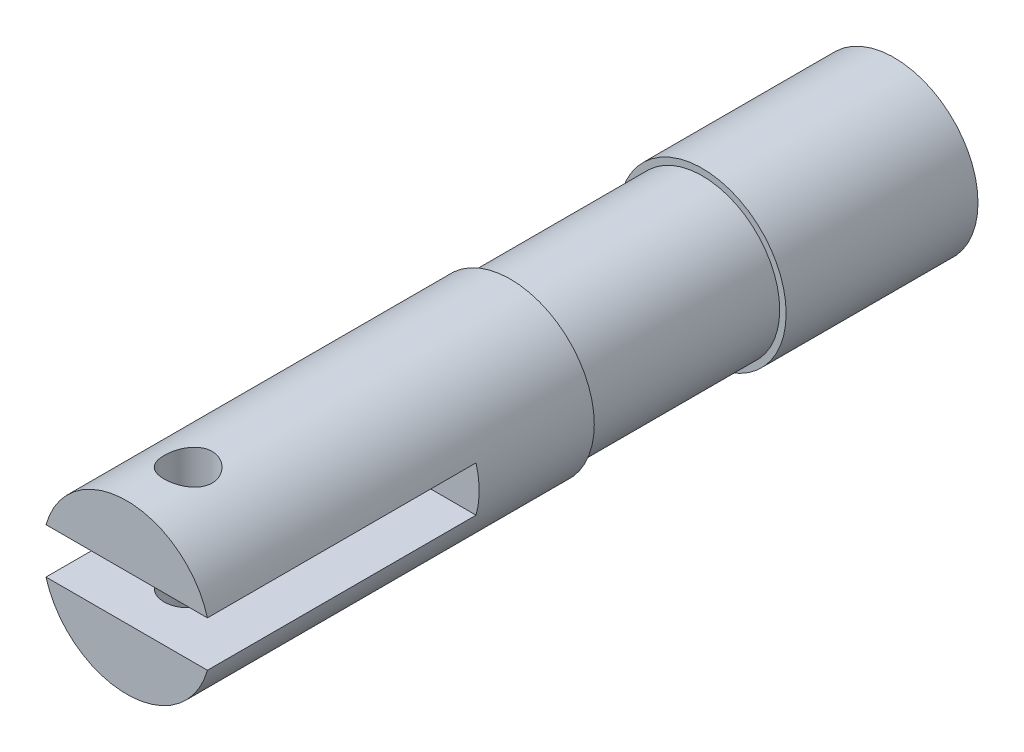
ISO-10303-21;
HEADER;
FILE_DESCRIPTION(('STEP AP214'),'2;1');
FILE_NAME('part.step','',(''),(''),'','','');
FILE_SCHEMA(('AUTOMOTIVE_DESIGN { 1 0 10303 214 1 1 1 1 }'));
ENDSEC;
DATA;
#1=APPLICATION_CONTEXT('core data for automotive mechanical design processes');
#2=APPLICATION_PROTOCOL_DEFINITION('international standard','automotive_design',2000,#1);
#3=PRODUCT_CONTEXT('',#1,'mechanical');
#4=PRODUCT('Part','Part','',(#3));
#5=PRODUCT_RELATED_PRODUCT_CATEGORY('part','',(#4));
#6=PRODUCT_DEFINITION_FORMATION('','',#4);
#7=PRODUCT_DEFINITION_CONTEXT('part definition',#1,'design');
#8=PRODUCT_DEFINITION('design','',#6,#7);
#9=PRODUCT_DEFINITION_SHAPE('','',#8);
#10=(LENGTH_UNIT() NAMED_UNIT(*) SI_UNIT(.MILLI.,.METRE.));
#11=(NAMED_UNIT(*) PLANE_ANGLE_UNIT() SI_UNIT($,.RADIAN.));
#12=(NAMED_UNIT(*) SI_UNIT($,.STERADIAN.) SOLID_ANGLE_UNIT());
#13=UNCERTAINTY_MEASURE_WITH_UNIT(LENGTH_MEASURE(1.E-05),#10,'distance_accuracy_value','');
#14=(GEOMETRIC_REPRESENTATION_CONTEXT(3) GLOBAL_UNCERTAINTY_ASSIGNED_CONTEXT((#13)) GLOBAL_UNIT_ASSIGNED_CONTEXT((#10,
#11,#12)) REPRESENTATION_CONTEXT('',''));
#15=CARTESIAN_POINT('',(0.,0.,0.));
#16=DIRECTION('',(0.,0.,1.));
#17=DIRECTION('',(1.,0.,0.));
#18=AXIS2_PLACEMENT_3D('',#15,#16,#17);
#19=CARTESIAN_POINT('',(0.,0.,38.1));
#20=DIRECTION('',(0.,0.,1.));
#21=DIRECTION('',(1.,0.,0.));
#22=AXIS2_PLACEMENT_3D('',#19,#20,#21);
#23=PLANE('',#22);
#24=DIRECTION('',(1.,0.,0.));
#25=VECTOR('',#24,1.);
#26=CARTESIAN_POINT('',(5.34335007368973,-1.5,38.1));
#27=LINE('',#26,#25);
#28=CARTESIAN_POINT('',(-5.34335007368973,-1.5,38.1));
#29=VERTEX_POINT('',#28);
#30=CARTESIAN_POINT('',(5.34335007368973,-1.5,38.1));
#31=VERTEX_POINT('',#30);
#32=EDGE_CURVE('E73',#29,#31,#27,.T.);
#33=ORIENTED_EDGE('',*,*,#32,.F.);
#34=CARTESIAN_POINT('',(0.,0.,38.1));
#35=DIRECTION('',(0.,0.,1.));
#36=DIRECTION('',(1.,0.,0.));
#37=AXIS2_PLACEMENT_3D('',#34,#35,#36);
#38=CIRCLE('',#37,5.5499);
#39=EDGE_CURVE('E43',#29,#31,#38,.T.);
#40=ORIENTED_EDGE('',*,*,#39,.T.);
#41=EDGE_LOOP('',(#33,#40));
#42=FACE_BOUND('',#41,.T.);
#43=ADVANCED_FACE('F33',(#42),#23,.T.);
#44=CARTESIAN_POINT('',(0.,0.,38.1));
#45=DIRECTION('',(0.,0.,-1.));
#46=DIRECTION('',(-1.,0.,0.));
#47=AXIS2_PLACEMENT_3D('',#44,#45,#46);
#48=CYLINDRICAL_SURFACE('',#47,5.5499);
#49=CARTESIAN_POINT('',(0.,0.,12.7));
#50=DIRECTION('',(0.,0.,1.));
#51=DIRECTION('',(1.,0.,0.));
#52=AXIS2_PLACEMENT_3D('',#49,#50,#51);
#53=CIRCLE('',#52,5.5499);
#54=CARTESIAN_POINT('',(5.5499,0.,12.7));
#55=VERTEX_POINT('',#54);
#56=EDGE_CURVE('E205',#55,#55,#53,.T.);
#57=ORIENTED_EDGE('',*,*,#56,.T.);
#58=EDGE_LOOP('',(#57));
#59=FACE_BOUND('',#58,.T.);
#60=CARTESIAN_POINT('',(0.,-5.5499,35.6235));
#61=CARTESIAN_POINT('',(0.0872724941734618,-5.54989896834257,35.6234984707263));
#62=CARTESIAN_POINT('',(0.174560703502965,-5.54782151876623,35.616279329323));
#63=CARTESIAN_POINT('',(0.346606940531385,-5.53973656836404,35.5876544648309));
#64=CARTESIAN_POINT('',(0.431364002750902,-5.53372758742275,35.5662433988258));
#65=CARTESIAN_POINT('',(0.595840818901869,-5.5184400865301,35.5099994785404));
#66=CARTESIAN_POINT('',(0.67556742518667,-5.50916613260381,35.475185361936));
#67=CARTESIAN_POINT('',(0.828051249460755,-5.48831953110385,35.3931972803331));
#68=CARTESIAN_POINT('',(0.900807732623364,-5.47674664155886,35.3460220141118));
#69=CARTESIAN_POINT('',(1.03920274769103,-5.45220218024309,35.2393399803399));
#70=CARTESIAN_POINT('',(1.10463159844073,-5.43920395049827,35.1795673402887));
#71=CARTESIAN_POINT('',(1.22468673918585,-5.41343794561223,35.0499546370002));
#72=CARTESIAN_POINT('',(1.27931140513751,-5.40067020537901,34.9801130629631));
#73=CARTESIAN_POINT('',(1.37727563395375,-5.37653289566469,34.8306144523242));
#74=CARTESIAN_POINT('',(1.42036565049793,-5.36519667943514,34.7507880056001));
#75=CARTESIAN_POINT('',(1.492426810994,-5.34560161598978,34.5846458384256));
#76=CARTESIAN_POINT('',(1.52140100010062,-5.33734210513839,34.4983315222208));
#77=CARTESIAN_POINT('',(1.56366394470877,-5.3251123216805,34.3240049091784));
#78=CARTESIAN_POINT('',(1.5773365731521,-5.32103729970711,34.2360932145847));
#79=CARTESIAN_POINT('',(1.5898062139296,-5.31732566668083,34.0591366395856));
#80=CARTESIAN_POINT('',(1.58860646672983,-5.31768808877569,33.9700920102533));
#81=CARTESIAN_POINT('',(1.57166831728128,-5.32271715888212,33.79646347849));
#82=CARTESIAN_POINT('',(1.55640357651009,-5.32724356991789,33.7118286456561));
#83=CARTESIAN_POINT('',(1.5125311528114,-5.3398647394061,33.5463749255446));
#84=CARTESIAN_POINT('',(1.48392226116893,-5.34795982110557,33.4655563846777));
#85=CARTESIAN_POINT('',(1.41380896237254,-5.36692299778615,33.3088381409805));
#86=CARTESIAN_POINT('',(1.37214561459069,-5.37782495836647,33.233013817701));
#87=CARTESIAN_POINT('',(1.27721669134951,-5.40115641330293,33.089270670165));
#88=CARTESIAN_POINT('',(1.2239485277728,-5.41358624813717,33.0213536145878));
#89=CARTESIAN_POINT('',(1.10493957469359,-5.4391481877115,32.8926575917568));
#90=CARTESIAN_POINT('',(1.03880362337619,-5.45228908339256,32.8322452082636));
#91=CARTESIAN_POINT('',(0.897176515351795,-5.47737426652169,32.7232878433217));
#92=CARTESIAN_POINT('',(0.821684871916074,-5.4893184916546,32.674743479696));
#93=CARTESIAN_POINT('',(0.662865835839815,-5.51075738718829,32.5907044686441));
#94=CARTESIAN_POINT('',(0.57949681653771,-5.52023792341386,32.5552846434936));
#95=CARTESIAN_POINT('',(0.407652430488587,-5.53557938747209,32.4990736669459));
#96=CARTESIAN_POINT('',(0.319178359995337,-5.54144122976479,32.4782788195667));
#97=CARTESIAN_POINT('',(0.142756904957587,-5.54874291946734,32.4525033260106));
#98=CARTESIAN_POINT('',(0.0548878476549356,-5.55032182170101,32.4470252014117));
#99=CARTESIAN_POINT('',(-0.120516599761047,-5.5492841581313,32.450653159662));
#100=CARTESIAN_POINT('',(-0.208052028741161,-5.54666809699664,32.459757488191));
#101=CARTESIAN_POINT('',(-0.378470860253106,-5.53762500887942,32.4918869379715));
#102=CARTESIAN_POINT('',(-0.461412521218146,-5.53127605002489,32.5146270743796));
#103=CARTESIAN_POINT('',(-0.622290119879763,-5.51549490931321,32.5730449298635));
#104=CARTESIAN_POINT('',(-0.700225476885458,-5.50606237055554,32.6087241465899));
#105=CARTESIAN_POINT('',(-0.850753159224852,-5.48484424367827,32.6928799028103));
#106=CARTESIAN_POINT('',(-0.923192994094234,-5.47301207001095,32.7416171468307));
#107=CARTESIAN_POINT('',(-1.0590378769447,-5.44835784490299,32.8501841160898));
#108=CARTESIAN_POINT('',(-1.12244085910737,-5.435535568155,32.9100163704704));
#109=CARTESIAN_POINT('',(-1.24056312535877,-5.4098217989191,33.041407019302));
#110=CARTESIAN_POINT('',(-1.29492951097843,-5.39694182256213,33.1132855772011));
#111=CARTESIAN_POINT('',(-1.39084613724155,-5.37302425024348,33.265423494594));
#112=CARTESIAN_POINT('',(-1.43239682171947,-5.36198659048461,33.3456825637244));
#113=CARTESIAN_POINT('',(-1.50119996213611,-5.34313227372482,33.5119718633803));
#114=CARTESIAN_POINT('',(-1.5285280201113,-5.33529863403326,33.5979687793713));
#115=CARTESIAN_POINT('',(-1.56824907412348,-5.32376003488255,33.7736051845963));
#116=CARTESIAN_POINT('',(-1.58064660859896,-5.32005382083362,33.8632435583659));
#117=CARTESIAN_POINT('',(-1.58986590919384,-5.31730537323854,34.0399760141655));
#118=CARTESIAN_POINT('',(-1.58725928591541,-5.31809196891816,34.1270380292939));
#119=CARTESIAN_POINT('',(-1.56789208986272,-5.32383360267543,34.2994260675869));
#120=CARTESIAN_POINT('',(-1.5511319914117,-5.32878850106137,34.3847521488293));
#121=CARTESIAN_POINT('',(-1.50428702898885,-5.34219902911262,34.5504050400885));
#122=CARTESIAN_POINT('',(-1.47434045539563,-5.35061826870816,34.6307741163339));
#123=CARTESIAN_POINT('',(-1.4020796024876,-5.37000520636908,34.785410637239));
#124=CARTESIAN_POINT('',(-1.35976313016336,-5.38097335624974,34.8596769969793));
#125=CARTESIAN_POINT('',(-1.26230376619992,-5.40468042481964,35.0026856153301));
#126=CARTESIAN_POINT('',(-1.20677913620843,-5.41746630785813,35.0711599511871));
#127=CARTESIAN_POINT('',(-1.08518341968836,-5.44312611056358,35.1980047316258));
#128=CARTESIAN_POINT('',(-1.01910967936042,-5.45600005160085,35.2563726260464));
#129=CARTESIAN_POINT('',(-0.876241567528388,-5.48078223121342,35.3628363749627));
#130=CARTESIAN_POINT('',(-0.799215077834475,-5.49265709499021,35.4106292533314));
#131=CARTESIAN_POINT('',(-0.637880821638567,-5.5137190316164,35.4925154594953));
#132=CARTESIAN_POINT('',(-0.553577051886057,-5.52290756780932,35.5266162496799));
#133=CARTESIAN_POINT('',(-0.391513919834384,-5.53659021644685,35.576483981923));
#134=CARTESIAN_POINT('',(-0.314348637182838,-5.54154229767636,35.5940702648676));
#135=CARTESIAN_POINT('',(-0.158126365730265,-5.54819743833673,35.6175781823509));
#136=CARTESIAN_POINT('',(-0.0790696327709008,-5.54990093469053,35.6235013855352));
#137=CARTESIAN_POINT('',(0.,-5.5499,35.6235));
#138=B_SPLINE_CURVE_WITH_KNOTS('',3,(#60,#61,#62,#63,#64,#65,#66,#67,#68,#69,#70,#71,#72,#73,
#74,#75,#76,#77,#78,#79,#80,#81,#82,#83,#84,#85,#86,#87,#88,#89,#90,#91,#92,#93,#94,#95,#96,#97,
#98,#99,#100,#101,#102,#103,#104,#105,#106,#107,#108,#109,#110,#111,#112,#113,#114,#115,#116,
#117,#118,#119,#120,#121,#122,#123,#124,#125,#126,#127,#128,#129,#130,#131,#132,#133,#134,#135,
#136,#137),.UNSPECIFIED.,.T.,.F.,(4,2,2,2,2,2,2,2,2,2,2,2,2,2,2,2,2,2,2,2,2,2,2,2,2,2,2,2,2,2,2,
2,2,2,2,2,2,2,4),(0.,0.261527247969741,0.523153010586956,0.784414336708987,1.04570317611949,
1.31318750640695,1.58071201341046,1.85362659669269,2.1264822790327,2.39232759881921,
2.65811499594338,2.91526634006719,3.17244098151897,3.43287713201013,3.69337142479462,
3.96370648798546,4.23405562123313,4.50592311488859,4.77772187826597,5.04058411128749,
5.30341472343887,5.56093487145812,5.81848483600105,6.08161913851189,6.34481349720002,
6.61663779663824,6.88845268117654,7.15880755200923,7.42908022218125,7.68912623370909,
7.94916353070069,8.206536383815,8.46395489322526,8.72998514974431,8.99608243623522,
9.26902710891233,9.54182282014954,9.77880063836502,10.0157465816705),.UNSPECIFIED.);
#139=CARTESIAN_POINT('',(0.,-5.5499,35.6235));
#140=VERTEX_POINT('',#139);
#141=EDGE_CURVE('E102',#140,#140,#138,.T.);
#142=ORIENTED_EDGE('',*,*,#141,.T.);
#143=EDGE_LOOP('',(#142));
#144=FACE_BOUND('',#143,.T.);
#145=CARTESIAN_POINT('',(0.,5.5499,35.6235));
#146=CARTESIAN_POINT('',(-0.0872724941734618,5.54989896834257,35.6234984707263));
#147=CARTESIAN_POINT('',(-0.174560703502965,5.54782151876623,35.616279329323));
#148=CARTESIAN_POINT('',(-0.346606940531385,5.53973656836404,35.5876544648309));
#149=CARTESIAN_POINT('',(-0.431364002750902,5.53372758742275,35.5662433988258));
#150=CARTESIAN_POINT('',(-0.595840818901869,5.5184400865301,35.5099994785404));
#151=CARTESIAN_POINT('',(-0.67556742518667,5.50916613260381,35.475185361936));
#152=CARTESIAN_POINT('',(-0.828051249460755,5.48831953110385,35.3931972803331));
#153=CARTESIAN_POINT('',(-0.900807732623364,5.47674664155886,35.3460220141118));
#154=CARTESIAN_POINT('',(-1.03920274769103,5.45220218024309,35.2393399803399));
#155=CARTESIAN_POINT('',(-1.10463159844073,5.43920395049827,35.1795673402887));
#156=CARTESIAN_POINT('',(-1.22468673918585,5.41343794561223,35.0499546370002));
#157=CARTESIAN_POINT('',(-1.27931140513751,5.40067020537901,34.9801130629631));
#158=CARTESIAN_POINT('',(-1.37727563395375,5.37653289566469,34.8306144523242));
#159=CARTESIAN_POINT('',(-1.42036565049793,5.36519667943514,34.7507880056001));
#160=CARTESIAN_POINT('',(-1.492426810994,5.34560161598978,34.5846458384256));
#161=CARTESIAN_POINT('',(-1.52140100010062,5.33734210513839,34.4983315222208));
#162=CARTESIAN_POINT('',(-1.56366394470877,5.3251123216805,34.3240049091784));
#163=CARTESIAN_POINT('',(-1.5773365731521,5.32103729970711,34.2360932145847));
#164=CARTESIAN_POINT('',(-1.5898062139296,5.31732566668083,34.0591366395856));
#165=CARTESIAN_POINT('',(-1.58860646672983,5.31768808877569,33.9700920102533));
#166=CARTESIAN_POINT('',(-1.57166831728128,5.32271715888212,33.79646347849));
#167=CARTESIAN_POINT('',(-1.55640357651009,5.32724356991789,33.7118286456561));
#168=CARTESIAN_POINT('',(-1.5125311528114,5.3398647394061,33.5463749255446));
#169=CARTESIAN_POINT('',(-1.48392226116893,5.34795982110557,33.4655563846777));
#170=CARTESIAN_POINT('',(-1.41380896237254,5.36692299778615,33.3088381409805));
#171=CARTESIAN_POINT('',(-1.37214561459069,5.37782495836647,33.233013817701));
#172=CARTESIAN_POINT('',(-1.27721669134951,5.40115641330293,33.089270670165));
#173=CARTESIAN_POINT('',(-1.2239485277728,5.41358624813717,33.0213536145878));
#174=CARTESIAN_POINT('',(-1.10493957469359,5.4391481877115,32.8926575917568));
#175=CARTESIAN_POINT('',(-1.03880362337619,5.45228908339256,32.8322452082636));
#176=CARTESIAN_POINT('',(-0.897176515351795,5.47737426652169,32.7232878433217));
#177=CARTESIAN_POINT('',(-0.821684871916074,5.4893184916546,32.674743479696));
#178=CARTESIAN_POINT('',(-0.662865835839815,5.51075738718829,32.5907044686441));
#179=CARTESIAN_POINT('',(-0.57949681653771,5.52023792341386,32.5552846434936));
#180=CARTESIAN_POINT('',(-0.407652430488587,5.53557938747209,32.4990736669459));
#181=CARTESIAN_POINT('',(-0.319178359995337,5.54144122976479,32.4782788195667));
#182=CARTESIAN_POINT('',(-0.142756904957587,5.54874291946734,32.4525033260106));
#183=CARTESIAN_POINT('',(-0.0548878476549356,5.55032182170101,32.4470252014117));
#184=CARTESIAN_POINT('',(0.120516599761047,5.5492841581313,32.450653159662));
#185=CARTESIAN_POINT('',(0.208052028741161,5.54666809699664,32.459757488191));
#186=CARTESIAN_POINT('',(0.378470860253106,5.53762500887942,32.4918869379715));
#187=CARTESIAN_POINT('',(0.461412521218146,5.53127605002489,32.5146270743796));
#188=CARTESIAN_POINT('',(0.622290119879763,5.51549490931321,32.5730449298635));
#189=CARTESIAN_POINT('',(0.700225476885458,5.50606237055554,32.6087241465899));
#190=CARTESIAN_POINT('',(0.850753159224852,5.48484424367827,32.6928799028103));
#191=CARTESIAN_POINT('',(0.923192994094234,5.47301207001095,32.7416171468307));
#192=CARTESIAN_POINT('',(1.0590378769447,5.44835784490299,32.8501841160898));
#193=CARTESIAN_POINT('',(1.12244085910737,5.435535568155,32.9100163704704));
#194=CARTESIAN_POINT('',(1.24056312535877,5.4098217989191,33.041407019302));
#195=CARTESIAN_POINT('',(1.29492951097843,5.39694182256213,33.1132855772011));
#196=CARTESIAN_POINT('',(1.39084613724155,5.37302425024348,33.265423494594));
#197=CARTESIAN_POINT('',(1.43239682171947,5.36198659048461,33.3456825637244));
#198=CARTESIAN_POINT('',(1.50119996213611,5.34313227372482,33.5119718633803));
#199=CARTESIAN_POINT('',(1.5285280201113,5.33529863403326,33.5979687793713));
#200=CARTESIAN_POINT('',(1.56824907412348,5.32376003488255,33.7736051845963));
#201=CARTESIAN_POINT('',(1.58064660859896,5.32005382083362,33.8632435583659));
#202=CARTESIAN_POINT('',(1.58986590919384,5.31730537323854,34.0399760141655));
#203=CARTESIAN_POINT('',(1.58725928591541,5.31809196891816,34.1270380292939));
#204=CARTESIAN_POINT('',(1.56789208986272,5.32383360267543,34.2994260675869));
#205=CARTESIAN_POINT('',(1.5511319914117,5.32878850106137,34.3847521488293));
#206=CARTESIAN_POINT('',(1.50428702898885,5.34219902911262,34.5504050400885));
#207=CARTESIAN_POINT('',(1.47434045539563,5.35061826870816,34.6307741163339));
#208=CARTESIAN_POINT('',(1.4020796024876,5.37000520636908,34.785410637239));
#209=CARTESIAN_POINT('',(1.35976313016336,5.38097335624974,34.8596769969793));
#210=CARTESIAN_POINT('',(1.26230376619992,5.40468042481964,35.0026856153301));
#211=CARTESIAN_POINT('',(1.20677913620843,5.41746630785813,35.0711599511871));
#212=CARTESIAN_POINT('',(1.08518341968836,5.44312611056358,35.1980047316258));
#213=CARTESIAN_POINT('',(1.01910967936042,5.45600005160085,35.2563726260464));
#214=CARTESIAN_POINT('',(0.876241567528388,5.48078223121342,35.3628363749627));
#215=CARTESIAN_POINT('',(0.799215077834475,5.49265709499021,35.4106292533314));
#216=CARTESIAN_POINT('',(0.637880821638567,5.5137190316164,35.4925154594953));
#217=CARTESIAN_POINT('',(0.553577051886057,5.52290756780932,35.5266162496799));
#218=CARTESIAN_POINT('',(0.391513919834384,5.53659021644685,35.576483981923));
#219=CARTESIAN_POINT('',(0.314348637182838,5.54154229767636,35.5940702648676));
#220=CARTESIAN_POINT('',(0.158126365730265,5.54819743833673,35.6175781823509));
#221=CARTESIAN_POINT('',(0.0790696327709008,5.54990093469053,35.6235013855352));
#222=CARTESIAN_POINT('',(0.,5.5499,35.6235));
#223=B_SPLINE_CURVE_WITH_KNOTS('',3,(#145,#146,#147,#148,#149,#150,#151,#152,#153,#154,#155,
#156,#157,#158,#159,#160,#161,#162,#163,#164,#165,#166,#167,#168,#169,#170,#171,#172,#173,#174,
#175,#176,#177,#178,#179,#180,#181,#182,#183,#184,#185,#186,#187,#188,#189,#190,#191,#192,#193,
#194,#195,#196,#197,#198,#199,#200,#201,#202,#203,#204,#205,#206,#207,#208,#209,#210,#211,#212,
#213,#214,#215,#216,#217,#218,#219,#220,#221,#222),.UNSPECIFIED.,.T.,.F.,(4,2,2,2,2,2,2,2,2,2,2,
2,2,2,2,2,2,2,2,2,2,2,2,2,2,2,2,2,2,2,2,2,2,2,2,2,2,2,4),(0.,0.261527247969741,
0.523153010586956,0.784414336708987,1.04570317611949,1.31318750640695,1.58071201341046,
1.85362659669269,2.1264822790327,2.39232759881921,2.65811499594338,2.91526634006719,
3.17244098151897,3.43287713201013,3.69337142479462,3.96370648798546,4.23405562123313,
4.50592311488859,4.77772187826597,5.04058411128749,5.30341472343887,5.56093487145812,
5.81848483600105,6.08161913851189,6.34481349720002,6.61663779663824,6.88845268117654,
7.15880755200923,7.42908022218125,7.68912623370909,7.94916353070069,8.206536383815,
8.46395489322526,8.72998514974431,8.99608243623522,9.26902710891233,9.54182282014954,
9.77880063836502,10.0157465816705),.UNSPECIFIED.);
#224=CARTESIAN_POINT('',(0.,5.5499,35.6235));
#225=VERTEX_POINT('',#224);
#226=EDGE_CURVE('E115',#225,#225,#223,.T.);
#227=ORIENTED_EDGE('',*,*,#226,.T.);
#228=EDGE_LOOP('',(#227));
#229=FACE_BOUND('',#228,.T.);
#230=ORIENTED_EDGE('',*,*,#39,.F.);
#231=DIRECTION('',(0.,0.,1.));
#232=VECTOR('',#231,1.);
#233=CARTESIAN_POINT('',(-5.34335007368973,-1.5,20.32));
#234=LINE('',#233,#232);
#235=CARTESIAN_POINT('',(-5.34335007368973,-1.5,20.32));
#236=VERTEX_POINT('',#235);
#237=EDGE_CURVE('E86',#236,#29,#234,.T.);
#238=ORIENTED_EDGE('',*,*,#237,.F.);
#239=CARTESIAN_POINT('',(0.,0.,20.32));
#240=DIRECTION('',(0.,0.,1.));
#241=DIRECTION('',(1.,0.,0.));
#242=AXIS2_PLACEMENT_3D('',#239,#240,#241);
#243=CIRCLE('',#242,5.5499);
#244=CARTESIAN_POINT('',(-5.34335007368973,1.5,20.32));
#245=VERTEX_POINT('',#244);
#246=EDGE_CURVE('E90',#245,#236,#243,.T.);
#247=ORIENTED_EDGE('',*,*,#246,.F.);
#248=DIRECTION('',(0.,0.,1.));
#249=VECTOR('',#248,1.);
#250=CARTESIAN_POINT('',(-5.34335007368973,1.5,20.32));
#251=LINE('',#250,#249);
#252=CARTESIAN_POINT('',(-5.34335007368973,1.5,38.1));
#253=VERTEX_POINT('',#252);
#254=EDGE_CURVE('E80',#245,#253,#251,.T.);
#255=ORIENTED_EDGE('',*,*,#254,.T.);
#256=CARTESIAN_POINT('',(5.34335007368973,1.5,38.1));
#257=VERTEX_POINT('',#256);
#258=EDGE_CURVE('E11',#257,#253,#38,.T.);
#259=ORIENTED_EDGE('',*,*,#258,.F.);
#260=DIRECTION('',(0.,0.,1.));
#261=VECTOR('',#260,1.);
#262=CARTESIAN_POINT('',(5.34335007368973,1.5,20.32));
#263=LINE('',#262,#261);
#264=CARTESIAN_POINT('',(5.34335007368973,1.5,20.32));
#265=VERTEX_POINT('',#264);
#266=EDGE_CURVE('E50',#265,#257,#263,.T.);
#267=ORIENTED_EDGE('',*,*,#266,.F.);
#268=CARTESIAN_POINT('',(0.,0.,20.32));
#269=DIRECTION('',(0.,0.,1.));
#270=DIRECTION('',(1.,0.,0.));
#271=AXIS2_PLACEMENT_3D('',#268,#269,#270);
#272=CIRCLE('',#271,5.5499);
#273=CARTESIAN_POINT('',(5.34335007368973,-1.5,20.32));
#274=VERTEX_POINT('',#273);
#275=EDGE_CURVE('E92',#274,#265,#272,.T.);
#276=ORIENTED_EDGE('',*,*,#275,.F.);
#277=DIRECTION('',(0.,0.,1.));
#278=VECTOR('',#277,1.);
#279=CARTESIAN_POINT('',(5.34335007368973,-1.5,20.32));
#280=LINE('',#279,#278);
#281=EDGE_CURVE('E59',#274,#31,#280,.T.);
#282=ORIENTED_EDGE('',*,*,#281,.T.);
#283=EDGE_LOOP('',(#230,#238,#247,#255,#259,#267,#276,#282));
#284=FACE_BOUND('',#283,.T.);
#285=ADVANCED_FACE('F35',(#59,#144,#229,#284),#48,.T.);
#286=DIRECTION('',(-1.,0.,0.));
#287=VECTOR('',#286,1.);
#288=CARTESIAN_POINT('',(5.34335007368973,1.5,38.1));
#289=LINE('',#288,#287);
#290=EDGE_CURVE('E82',#257,#253,#289,.T.);
#291=ORIENTED_EDGE('',*,*,#290,.F.);
#292=ORIENTED_EDGE('',*,*,#258,.T.);
#293=EDGE_LOOP('',(#291,#292));
#294=FACE_BOUND('',#293,.T.);
#295=ADVANCED_FACE('F134',(#294),#23,.T.);
#296=CARTESIAN_POINT('',(5.34335007368973,-1.5,20.32));
#297=DIRECTION('',(0.,-1.,0.));
#298=DIRECTION('',(0.,0.,-1.));
#299=AXIS2_PLACEMENT_3D('',#296,#297,#298);
#300=PLANE('',#299);
#301=CARTESIAN_POINT('',(0.,-1.5,34.036));
#302=DIRECTION('',(0.,-1.,0.));
#303=DIRECTION('',(0.,0.,-1.));
#304=AXIS2_PLACEMENT_3D('',#301,#302,#303);
#305=CIRCLE('',#304,1.5875);
#306=CARTESIAN_POINT('',(0.,-1.5,32.4485));
#307=VERTEX_POINT('',#306);
#308=EDGE_CURVE('E208',#307,#307,#305,.T.);
#309=ORIENTED_EDGE('',*,*,#308,.T.);
#310=EDGE_LOOP('',(#309));
#311=FACE_BOUND('',#310,.T.);
#312=ORIENTED_EDGE('',*,*,#32,.T.);
#313=ORIENTED_EDGE('',*,*,#281,.F.);
#314=DIRECTION('',(1.,0.,0.));
#315=VECTOR('',#314,1.);
#316=CARTESIAN_POINT('',(5.34335007368973,-1.5,20.32));
#317=LINE('',#316,#315);
#318=EDGE_CURVE('E96',#236,#274,#317,.T.);
#319=ORIENTED_EDGE('',*,*,#318,.F.);
#320=ORIENTED_EDGE('',*,*,#237,.T.);
#321=EDGE_LOOP('',(#312,#313,#319,#320));
#322=FACE_BOUND('',#321,.T.);
#323=ADVANCED_FACE('F106',(#311,#322),#300,.F.);
#324=CARTESIAN_POINT('',(5.34335007368973,1.5,20.32));
#325=DIRECTION('',(0.,1.,0.));
#326=DIRECTION('',(0.,0.,1.));
#327=AXIS2_PLACEMENT_3D('',#324,#325,#326);
#328=PLANE('',#327);
#329=CARTESIAN_POINT('',(0.,1.5,34.036));
#330=DIRECTION('',(0.,1.,0.));
#331=DIRECTION('',(0.,0.,1.));
#332=AXIS2_PLACEMENT_3D('',#329,#330,#331);
#333=CIRCLE('',#332,1.5875);
#334=CARTESIAN_POINT('',(0.,1.5,35.6235));
#335=VERTEX_POINT('',#334);
#336=EDGE_CURVE('E38',#335,#335,#333,.T.);
#337=ORIENTED_EDGE('',*,*,#336,.T.);
#338=EDGE_LOOP('',(#337));
#339=FACE_BOUND('',#338,.T.);
#340=ORIENTED_EDGE('',*,*,#290,.T.);
#341=ORIENTED_EDGE('',*,*,#254,.F.);
#342=DIRECTION('',(-1.,0.,0.));
#343=VECTOR('',#342,1.);
#344=CARTESIAN_POINT('',(5.34335007368973,1.5,20.32));
#345=LINE('',#344,#343);
#346=EDGE_CURVE('E77',#265,#245,#345,.T.);
#347=ORIENTED_EDGE('',*,*,#346,.F.);
#348=ORIENTED_EDGE('',*,*,#266,.T.);
#349=EDGE_LOOP('',(#340,#341,#347,#348));
#350=FACE_BOUND('',#349,.T.);
#351=ADVANCED_FACE('F81',(#339,#350),#328,.F.);
#352=CARTESIAN_POINT('',(0.,0.,20.32));
#353=DIRECTION('',(0.,0.,1.));
#354=DIRECTION('',(1.,0.,0.));
#355=AXIS2_PLACEMENT_3D('',#352,#353,#354);
#356=PLANE('',#355);
#357=ORIENTED_EDGE('',*,*,#275,.T.);
#358=ORIENTED_EDGE('',*,*,#346,.T.);
#359=ORIENTED_EDGE('',*,*,#246,.T.);
#360=ORIENTED_EDGE('',*,*,#318,.T.);
#361=EDGE_LOOP('',(#357,#358,#359,#360));
#362=FACE_BOUND('',#361,.T.);
#363=ADVANCED_FACE('F89',(#362),#356,.T.);
#364=CARTESIAN_POINT('',(0.,-5.5499,34.036));
#365=DIRECTION('',(0.,1.,0.));
#366=DIRECTION('',(0.,0.,1.));
#367=AXIS2_PLACEMENT_3D('',#364,#365,#366);
#368=CYLINDRICAL_SURFACE('',#367,1.5875);
#369=ORIENTED_EDGE('',*,*,#336,.F.);
#370=EDGE_LOOP('',(#369));
#371=FACE_BOUND('',#370,.T.);
#372=ORIENTED_EDGE('',*,*,#226,.F.);
#373=EDGE_LOOP('',(#372));
#374=FACE_BOUND('',#373,.T.);
#375=ADVANCED_FACE('F125',(#371,#374),#368,.F.);
#376=ORIENTED_EDGE('',*,*,#308,.F.);
#377=EDGE_LOOP('',(#376));
#378=FACE_BOUND('',#377,.T.);
#379=ORIENTED_EDGE('',*,*,#141,.F.);
#380=EDGE_LOOP('',(#379));
#381=FACE_BOUND('',#380,.T.);
#382=ADVANCED_FACE('F119',(#378,#381),#368,.F.);
#383=CARTESIAN_POINT('',(0.,0.,12.7));
#384=DIRECTION('',(0.,0.,1.));
#385=DIRECTION('',(1.,0.,0.));
#386=AXIS2_PLACEMENT_3D('',#383,#384,#385);
#387=PLANE('',#386);
#388=ORIENTED_EDGE('',*,*,#56,.F.);
#389=EDGE_LOOP('',(#388));
#390=FACE_BOUND('',#389,.T.);
#391=CARTESIAN_POINT('',(0.,0.,12.7));
#392=DIRECTION('',(0.,0.,1.));
#393=DIRECTION('',(1.,0.,0.));
#394=AXIS2_PLACEMENT_3D('',#391,#392,#393);
#395=CIRCLE('',#394,5.12385247959859);
#396=CARTESIAN_POINT('',(5.12385247959859,0.,12.7));
#397=VERTEX_POINT('',#396);
#398=EDGE_CURVE('E262',#397,#397,#395,.T.);
#399=ORIENTED_EDGE('',*,*,#398,.T.);
#400=EDGE_LOOP('',(#399));
#401=FACE_BOUND('',#400,.T.);
#402=ADVANCED_FACE('F124',(#390,#401),#387,.F.);
#403=CARTESIAN_POINT('',(0.,0.,0.));
#404=DIRECTION('',(0.,0.,1.));
#405=DIRECTION('',(1.,0.,0.));
#406=AXIS2_PLACEMENT_3D('',#403,#404,#405);
#407=PLANE('',#406);
#408=CARTESIAN_POINT('',(0.,0.,0.));
#409=DIRECTION('',(0.,0.,1.));
#410=DIRECTION('',(1.,0.,0.));
#411=AXIS2_PLACEMENT_3D('',#408,#409,#410);
#412=CIRCLE('',#411,5.5499);
#413=CARTESIAN_POINT('',(5.5499,0.,0.));
#414=VERTEX_POINT('',#413);
#415=EDGE_CURVE('E210',#414,#414,#412,.T.);
#416=ORIENTED_EDGE('',*,*,#415,.T.);
#417=EDGE_LOOP('',(#416));
#418=FACE_BOUND('',#417,.T.);
#419=CARTESIAN_POINT('',(0.,0.,0.));
#420=DIRECTION('',(0.,0.,1.));
#421=DIRECTION('',(1.,0.,0.));
#422=AXIS2_PLACEMENT_3D('',#419,#420,#421);
#423=CIRCLE('',#422,5.12385247959859);
#424=CARTESIAN_POINT('',(5.12385247959859,0.,0.));
#425=VERTEX_POINT('',#424);
#426=EDGE_CURVE('E264',#425,#425,#423,.T.);
#427=ORIENTED_EDGE('',*,*,#426,.F.);
#428=EDGE_LOOP('',(#427));
#429=FACE_BOUND('',#428,.T.);
#430=ADVANCED_FACE('F168',(#418,#429),#407,.T.);
#431=CARTESIAN_POINT('',(0.,0.,12.7));
#432=DIRECTION('',(0.,0.,-1.));
#433=DIRECTION('',(-1.,0.,0.));
#434=AXIS2_PLACEMENT_3D('',#431,#432,#433);
#435=CYLINDRICAL_SURFACE('',#434,5.12385247959859);
#436=ORIENTED_EDGE('',*,*,#398,.F.);
#437=EDGE_LOOP('',(#436));
#438=FACE_BOUND('',#437,.T.);
#439=ORIENTED_EDGE('',*,*,#426,.T.);
#440=EDGE_LOOP('',(#439));
#441=FACE_BOUND('',#440,.T.);
#442=ADVANCED_FACE('F179',(#438,#441),#435,.T.);
#443=CARTESIAN_POINT('',(0.,0.,-12.7));
#444=DIRECTION('',(0.,0.,1.));
#445=DIRECTION('',(1.,0.,0.));
#446=AXIS2_PLACEMENT_3D('',#443,#444,#445);
#447=PLANE('',#446);
#448=CARTESIAN_POINT('',(0.,0.,-12.7));
#449=DIRECTION('',(0.,0.,1.));
#450=DIRECTION('',(1.,0.,0.));
#451=AXIS2_PLACEMENT_3D('',#448,#449,#450);
#452=CIRCLE('',#451,5.5499);
#453=CARTESIAN_POINT('',(5.5499,0.,-12.7));
#454=VERTEX_POINT('',#453);
#455=EDGE_CURVE('E204',#454,#454,#452,.T.);
#456=ORIENTED_EDGE('',*,*,#455,.F.);
#457=EDGE_LOOP('',(#456));
#458=FACE_BOUND('',#457,.T.);
#459=ADVANCED_FACE('F127',(#458),#447,.F.);
#460=ORIENTED_EDGE('',*,*,#455,.T.);
#461=EDGE_LOOP('',(#460));
#462=FACE_BOUND('',#461,.T.);
#463=ORIENTED_EDGE('',*,*,#415,.F.);
#464=EDGE_LOOP('',(#463));
#465=FACE_BOUND('',#464,.T.);
#466=ADVANCED_FACE('F144',(#462,#465),#48,.T.);
#467=CLOSED_SHELL('',(#43,#285,#295,#323,#351,#363,#375,#382,#402,#430,#442,#459,#466));
#468=MANIFOLD_SOLID_BREP('B2',#467);
#469=ADVANCED_BREP_SHAPE_REPRESENTATION('',(#18,#468),#14);
#470=SHAPE_DEFINITION_REPRESENTATION(#9,#469);
ENDSEC;
END-ISO-10303-21;
